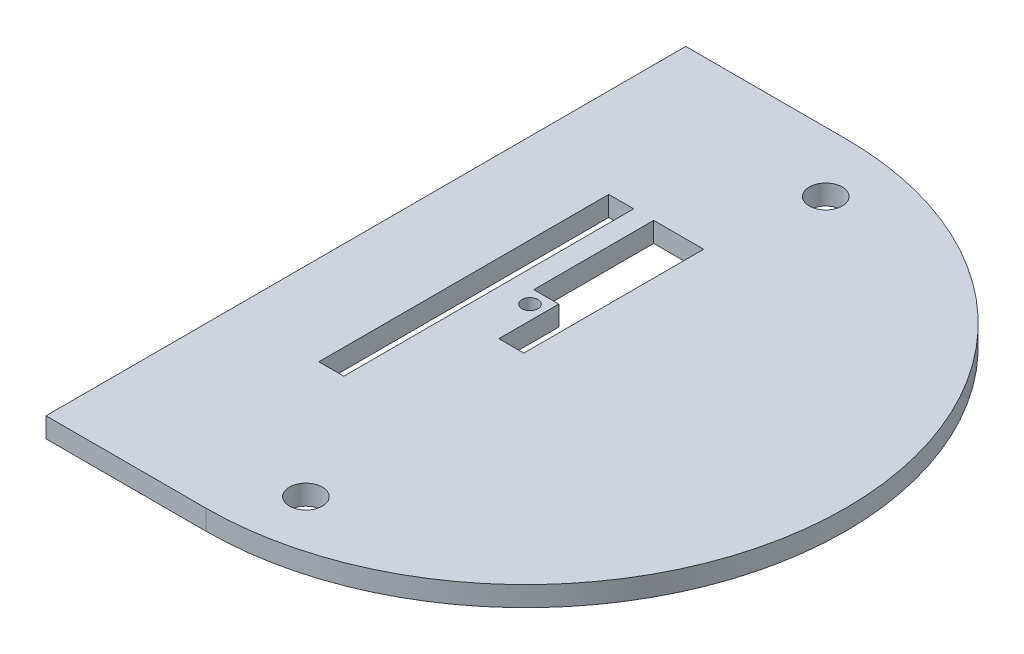
ISO-10303-21;
HEADER;
FILE_DESCRIPTION(('STEP AP214'),'2;1');
FILE_NAME('part.step','',(''),(''),'','','');
FILE_SCHEMA(('AUTOMOTIVE_DESIGN { 1 0 10303 214 1 1 1 1 }'));
ENDSEC;
DATA;
#1=APPLICATION_CONTEXT('core data for automotive mechanical design processes');
#2=APPLICATION_PROTOCOL_DEFINITION('international standard','automotive_design',2000,#1);
#3=PRODUCT_CONTEXT('',#1,'mechanical');
#4=PRODUCT('Part','Part','',(#3));
#5=PRODUCT_RELATED_PRODUCT_CATEGORY('part','',(#4));
#6=PRODUCT_DEFINITION_FORMATION('','',#4);
#7=PRODUCT_DEFINITION_CONTEXT('part definition',#1,'design');
#8=PRODUCT_DEFINITION('design','',#6,#7);
#9=PRODUCT_DEFINITION_SHAPE('','',#8);
#10=(LENGTH_UNIT() NAMED_UNIT(*) SI_UNIT(.MILLI.,.METRE.));
#11=(NAMED_UNIT(*) PLANE_ANGLE_UNIT() SI_UNIT($,.RADIAN.));
#12=(NAMED_UNIT(*) SI_UNIT($,.STERADIAN.) SOLID_ANGLE_UNIT());
#13=UNCERTAINTY_MEASURE_WITH_UNIT(LENGTH_MEASURE(1.E-05),#10,'distance_accuracy_value','');
#14=(GEOMETRIC_REPRESENTATION_CONTEXT(3) GLOBAL_UNCERTAINTY_ASSIGNED_CONTEXT((#13)) GLOBAL_UNIT_ASSIGNED_CONTEXT((#10,
#11,#12)) REPRESENTATION_CONTEXT('',''));
#15=CARTESIAN_POINT('',(0.,0.,0.));
#16=DIRECTION('',(0.,0.,1.));
#17=DIRECTION('',(1.,0.,0.));
#18=AXIS2_PLACEMENT_3D('',#15,#16,#17);
#19=CARTESIAN_POINT('',(0.,2.,52.2794018723784));
#20=DIRECTION('',(0.,0.,-1.));
#21=DIRECTION('',(-1.,0.,0.));
#22=AXIS2_PLACEMENT_3D('',#19,#20,#21);
#23=PLANE('',#22);
#24=DIRECTION('',(1.,0.,0.));
#25=VECTOR('',#24,1.);
#26=CARTESIAN_POINT('',(0.,0.,52.2794018723784));
#27=LINE('',#26,#25);
#28=CARTESIAN_POINT('',(-71.2900934623342,0.,52.2794018723784));
#29=VERTEX_POINT('',#28);
#30=CARTESIAN_POINT('',(-55.2900934623342,0.,52.2794018723784));
#31=VERTEX_POINT('',#30);
#32=EDGE_CURVE('E203',#29,#31,#27,.T.);
#33=ORIENTED_EDGE('',*,*,#32,.T.);
#34=DIRECTION('',(0.,-1.,0.));
#35=VECTOR('',#34,1.);
#36=CARTESIAN_POINT('',(-55.2900934623342,2.,52.2794018723784));
#37=LINE('',#36,#35);
#38=CARTESIAN_POINT('',(-55.2900934623342,2.,52.2794018723784));
#39=VERTEX_POINT('',#38);
#40=EDGE_CURVE('E11',#39,#31,#37,.T.);
#41=ORIENTED_EDGE('',*,*,#40,.F.);
#42=DIRECTION('',(1.,0.,0.));
#43=VECTOR('',#42,1.);
#44=CARTESIAN_POINT('',(0.,2.,52.2794018723784));
#45=LINE('',#44,#43);
#46=CARTESIAN_POINT('',(-71.2900934623342,2.,52.2794018723784));
#47=VERTEX_POINT('',#46);
#48=EDGE_CURVE('E155',#47,#39,#45,.T.);
#49=ORIENTED_EDGE('',*,*,#48,.F.);
#50=DIRECTION('',(0.,-1.,0.));
#51=VECTOR('',#50,1.);
#52=CARTESIAN_POINT('',(-71.2900934623342,2.,52.2794018723784));
#53=LINE('',#52,#51);
#54=EDGE_CURVE('E210',#47,#29,#53,.T.);
#55=ORIENTED_EDGE('',*,*,#54,.T.);
#56=EDGE_LOOP('',(#33,#41,#49,#55));
#57=FACE_BOUND('',#56,.T.);
#58=ADVANCED_FACE('F37',(#57),#23,.F.);
#59=CARTESIAN_POINT('',(-55.2900934623342,2.,20.2794018723784));
#60=DIRECTION('',(0.,-1.,0.));
#61=DIRECTION('',(0.,0.,-1.));
#62=AXIS2_PLACEMENT_3D('',#59,#60,#61);
#63=CYLINDRICAL_SURFACE('',#62,32.);
#64=CARTESIAN_POINT('',(-55.2900934623342,0.,20.2794018723784));
#65=DIRECTION('',(0.,1.,0.));
#66=DIRECTION('',(0.,0.,1.));
#67=AXIS2_PLACEMENT_3D('',#64,#65,#66);
#68=CIRCLE('',#67,32.);
#69=CARTESIAN_POINT('',(-55.2900934623342,0.,-11.7205981276216));
#70=VERTEX_POINT('',#69);
#71=EDGE_CURVE('E160',#31,#70,#68,.T.);
#72=ORIENTED_EDGE('',*,*,#71,.T.);
#73=DIRECTION('',(0.,-1.,0.));
#74=VECTOR('',#73,1.);
#75=CARTESIAN_POINT('',(-55.2900934623342,2.,-11.7205981276216));
#76=LINE('',#75,#74);
#77=CARTESIAN_POINT('',(-55.2900934623342,2.,-11.7205981276216));
#78=VERTEX_POINT('',#77);
#79=EDGE_CURVE('E47',#78,#70,#76,.T.);
#80=ORIENTED_EDGE('',*,*,#79,.F.);
#81=CARTESIAN_POINT('',(-55.2900934623342,2.,20.2794018723784));
#82=DIRECTION('',(0.,1.,0.));
#83=DIRECTION('',(0.,0.,1.));
#84=AXIS2_PLACEMENT_3D('',#81,#82,#83);
#85=CIRCLE('',#84,32.);
#86=EDGE_CURVE('E149',#39,#78,#85,.T.);
#87=ORIENTED_EDGE('',*,*,#86,.F.);
#88=ORIENTED_EDGE('',*,*,#40,.T.);
#89=EDGE_LOOP('',(#72,#80,#87,#88));
#90=FACE_BOUND('',#89,.T.);
#91=ADVANCED_FACE('F159',(#90),#63,.T.);
#92=CARTESIAN_POINT('',(0.,2.,-11.7205981276216));
#93=DIRECTION('',(0.,0.,1.));
#94=DIRECTION('',(1.,0.,0.));
#95=AXIS2_PLACEMENT_3D('',#92,#93,#94);
#96=PLANE('',#95);
#97=DIRECTION('',(-1.,0.,0.));
#98=VECTOR('',#97,1.);
#99=CARTESIAN_POINT('',(0.,0.,-11.7205981276216));
#100=LINE('',#99,#98);
#101=CARTESIAN_POINT('',(-71.2900934623342,0.,-11.7205981276216));
#102=VERTEX_POINT('',#101);
#103=EDGE_CURVE('E103',#70,#102,#100,.T.);
#104=ORIENTED_EDGE('',*,*,#103,.T.);
#105=DIRECTION('',(0.,-1.,0.));
#106=VECTOR('',#105,1.);
#107=CARTESIAN_POINT('',(-71.2900934623342,2.,-11.7205981276216));
#108=LINE('',#107,#106);
#109=CARTESIAN_POINT('',(-71.2900934623342,2.,-11.7205981276216));
#110=VERTEX_POINT('',#109);
#111=EDGE_CURVE('E161',#110,#102,#108,.T.);
#112=ORIENTED_EDGE('',*,*,#111,.F.);
#113=DIRECTION('',(-1.,0.,0.));
#114=VECTOR('',#113,1.);
#115=CARTESIAN_POINT('',(0.,2.,-11.7205981276216));
#116=LINE('',#115,#114);
#117=EDGE_CURVE('E153',#78,#110,#116,.T.);
#118=ORIENTED_EDGE('',*,*,#117,.F.);
#119=ORIENTED_EDGE('',*,*,#79,.T.);
#120=EDGE_LOOP('',(#104,#112,#118,#119));
#121=FACE_BOUND('',#120,.T.);
#122=ADVANCED_FACE('F163',(#121),#96,.F.);
#123=CARTESIAN_POINT('',(0.,2.,4.95310922918399));
#124=DIRECTION('',(0.,0.,-1.));
#125=DIRECTION('',(-1.,0.,0.));
#126=AXIS2_PLACEMENT_3D('',#123,#124,#125);
#127=PLANE('',#126);
#128=DIRECTION('',(1.,0.,0.));
#129=VECTOR('',#128,1.);
#130=CARTESIAN_POINT('',(0.,0.,4.95310922918399));
#131=LINE('',#130,#129);
#132=CARTESIAN_POINT('',(-62.32331882412,0.,4.95310922918399));
#133=VERTEX_POINT('',#132);
#134=CARTESIAN_POINT('',(-59.82331882412,0.,4.95310922918399));
#135=VERTEX_POINT('',#134);
#136=EDGE_CURVE('E191',#133,#135,#131,.T.);
#137=ORIENTED_EDGE('',*,*,#136,.T.);
#138=DIRECTION('',(0.,-1.,0.));
#139=VECTOR('',#138,1.);
#140=CARTESIAN_POINT('',(-59.82331882412,2.,4.95310922918399));
#141=LINE('',#140,#139);
#142=CARTESIAN_POINT('',(-59.82331882412,2.,4.95310922918399));
#143=VERTEX_POINT('',#142);
#144=EDGE_CURVE('E212',#143,#135,#141,.T.);
#145=ORIENTED_EDGE('',*,*,#144,.F.);
#146=DIRECTION('',(1.,0.,0.));
#147=VECTOR('',#146,1.);
#148=CARTESIAN_POINT('',(0.,2.,4.95310922918399));
#149=LINE('',#148,#147);
#150=CARTESIAN_POINT('',(-62.32331882412,2.,4.95310922918399));
#151=VERTEX_POINT('',#150);
#152=EDGE_CURVE('E260',#151,#143,#149,.T.);
#153=ORIENTED_EDGE('',*,*,#152,.F.);
#154=DIRECTION('',(0.,-1.,0.));
#155=VECTOR('',#154,1.);
#156=CARTESIAN_POINT('',(-62.32331882412,2.,4.95310922918399));
#157=LINE('',#156,#155);
#158=EDGE_CURVE('E214',#151,#133,#157,.T.);
#159=ORIENTED_EDGE('',*,*,#158,.T.);
#160=EDGE_LOOP('',(#137,#145,#153,#159));
#161=FACE_BOUND('',#160,.T.);
#162=ADVANCED_FACE('F288',(#161),#127,.F.);
#163=CARTESIAN_POINT('',(-59.82331882412,2.,0.));
#164=DIRECTION('',(-1.,0.,0.));
#165=DIRECTION('',(0.,0.,1.));
#166=AXIS2_PLACEMENT_3D('',#163,#164,#165);
#167=PLANE('',#166);
#168=DIRECTION('',(0.,0.,-1.));
#169=VECTOR('',#168,1.);
#170=CARTESIAN_POINT('',(-59.82331882412,0.,0.));
#171=LINE('',#170,#169);
#172=CARTESIAN_POINT('',(-59.82331882412,0.,33.953109229184));
#173=VERTEX_POINT('',#172);
#174=EDGE_CURVE('E194',#173,#135,#171,.T.);
#175=ORIENTED_EDGE('',*,*,#174,.F.);
#176=DIRECTION('',(0.,-1.,0.));
#177=VECTOR('',#176,1.);
#178=CARTESIAN_POINT('',(-59.82331882412,2.,33.953109229184));
#179=LINE('',#178,#177);
#180=CARTESIAN_POINT('',(-59.82331882412,2.,33.953109229184));
#181=VERTEX_POINT('',#180);
#182=EDGE_CURVE('E218',#181,#173,#179,.T.);
#183=ORIENTED_EDGE('',*,*,#182,.F.);
#184=DIRECTION('',(0.,0.,-1.));
#185=VECTOR('',#184,1.);
#186=CARTESIAN_POINT('',(-59.82331882412,2.,0.));
#187=LINE('',#186,#185);
#188=EDGE_CURVE('E262',#181,#143,#187,.T.);
#189=ORIENTED_EDGE('',*,*,#188,.T.);
#190=ORIENTED_EDGE('',*,*,#144,.T.);
#191=EDGE_LOOP('',(#175,#183,#189,#190));
#192=FACE_BOUND('',#191,.T.);
#193=ADVANCED_FACE('F290',(#192),#167,.T.);
#194=CARTESIAN_POINT('',(0.,2.,33.953109229184));
#195=DIRECTION('',(0.,0.,-1.));
#196=DIRECTION('',(-1.,0.,0.));
#197=AXIS2_PLACEMENT_3D('',#194,#195,#196);
#198=PLANE('',#197);
#199=DIRECTION('',(1.,0.,0.));
#200=VECTOR('',#199,1.);
#201=CARTESIAN_POINT('',(0.,0.,33.953109229184));
#202=LINE('',#201,#200);
#203=CARTESIAN_POINT('',(-62.32331882412,0.,33.953109229184));
#204=VERTEX_POINT('',#203);
#205=EDGE_CURVE('E197',#204,#173,#202,.T.);
#206=ORIENTED_EDGE('',*,*,#205,.F.);
#207=DIRECTION('',(0.,-1.,0.));
#208=VECTOR('',#207,1.);
#209=CARTESIAN_POINT('',(-62.32331882412,2.,33.953109229184));
#210=LINE('',#209,#208);
#211=CARTESIAN_POINT('',(-62.32331882412,2.,33.953109229184));
#212=VERTEX_POINT('',#211);
#213=EDGE_CURVE('E216',#212,#204,#210,.T.);
#214=ORIENTED_EDGE('',*,*,#213,.F.);
#215=DIRECTION('',(1.,0.,0.));
#216=VECTOR('',#215,1.);
#217=CARTESIAN_POINT('',(0.,2.,33.953109229184));
#218=LINE('',#217,#216);
#219=EDGE_CURVE('E265',#212,#181,#218,.T.);
#220=ORIENTED_EDGE('',*,*,#219,.T.);
#221=ORIENTED_EDGE('',*,*,#182,.T.);
#222=EDGE_LOOP('',(#206,#214,#220,#221));
#223=FACE_BOUND('',#222,.T.);
#224=ADVANCED_FACE('F281',(#223),#198,.T.);
#225=CARTESIAN_POINT('',(-57.82331882412,2.,0.));
#226=DIRECTION('',(1.,0.,0.));
#227=DIRECTION('',(0.,0.,-1.));
#228=AXIS2_PLACEMENT_3D('',#225,#226,#227);
#229=PLANE('',#228);
#230=DIRECTION('',(0.,0.,1.));
#231=VECTOR('',#230,1.);
#232=CARTESIAN_POINT('',(-57.82331882412,0.,0.));
#233=LINE('',#232,#231);
#234=CARTESIAN_POINT('',(-57.82331882412,0.,4.95310922918399));
#235=VERTEX_POINT('',#234);
#236=CARTESIAN_POINT('',(-57.82331882412,0.,16.953109229184));
#237=VERTEX_POINT('',#236);
#238=EDGE_CURVE('E169',#235,#237,#233,.T.);
#239=ORIENTED_EDGE('',*,*,#238,.F.);
#240=DIRECTION('',(0.,-1.,0.));
#241=VECTOR('',#240,1.);
#242=CARTESIAN_POINT('',(-57.82331882412,2.,4.95310922918399));
#243=LINE('',#242,#241);
#244=CARTESIAN_POINT('',(-57.82331882412,2.,4.95310922918399));
#245=VERTEX_POINT('',#244);
#246=EDGE_CURVE('E117',#245,#235,#243,.T.);
#247=ORIENTED_EDGE('',*,*,#246,.F.);
#248=DIRECTION('',(0.,0.,1.));
#249=VECTOR('',#248,1.);
#250=CARTESIAN_POINT('',(-57.82331882412,2.,0.));
#251=LINE('',#250,#249);
#252=CARTESIAN_POINT('',(-57.82331882412,2.,16.953109229184));
#253=VERTEX_POINT('',#252);
#254=EDGE_CURVE('E209',#245,#253,#251,.T.);
#255=ORIENTED_EDGE('',*,*,#254,.T.);
#256=DIRECTION('',(0.,-1.,0.));
#257=VECTOR('',#256,1.);
#258=CARTESIAN_POINT('',(-57.82331882412,2.,16.953109229184));
#259=LINE('',#258,#257);
#260=EDGE_CURVE('E165',#253,#237,#259,.T.);
#261=ORIENTED_EDGE('',*,*,#260,.T.);
#262=EDGE_LOOP('',(#239,#247,#255,#261));
#263=FACE_BOUND('',#262,.T.);
#264=ADVANCED_FACE('F39',(#263),#229,.T.);
#265=CARTESIAN_POINT('',(0.,2.,4.95310922918399));
#266=DIRECTION('',(0.,0.,-1.));
#267=DIRECTION('',(-1.,0.,0.));
#268=AXIS2_PLACEMENT_3D('',#265,#266,#267);
#269=PLANE('',#268);
#270=DIRECTION('',(1.,0.,0.));
#271=VECTOR('',#270,1.);
#272=CARTESIAN_POINT('',(0.,0.,4.95310922918399));
#273=LINE('',#272,#271);
#274=CARTESIAN_POINT('',(-52.82331882412,0.,4.95310922918399));
#275=VERTEX_POINT('',#274);
#276=EDGE_CURVE('E172',#235,#275,#273,.T.);
#277=ORIENTED_EDGE('',*,*,#276,.T.);
#278=DIRECTION('',(0.,-1.,0.));
#279=VECTOR('',#278,1.);
#280=CARTESIAN_POINT('',(-52.82331882412,2.,4.95310922918399));
#281=LINE('',#280,#279);
#282=CARTESIAN_POINT('',(-52.82331882412,2.,4.95310922918399));
#283=VERTEX_POINT('',#282);
#284=EDGE_CURVE('E228',#283,#275,#281,.T.);
#285=ORIENTED_EDGE('',*,*,#284,.F.);
#286=DIRECTION('',(1.,0.,0.));
#287=VECTOR('',#286,1.);
#288=CARTESIAN_POINT('',(0.,2.,4.95310922918399));
#289=LINE('',#288,#287);
#290=EDGE_CURVE('E243',#245,#283,#289,.T.);
#291=ORIENTED_EDGE('',*,*,#290,.F.);
#292=ORIENTED_EDGE('',*,*,#246,.T.);
#293=EDGE_LOOP('',(#277,#285,#291,#292));
#294=FACE_BOUND('',#293,.T.);
#295=ADVANCED_FACE('F331',(#294),#269,.F.);
#296=CARTESIAN_POINT('',(-52.82331882412,2.,0.));
#297=DIRECTION('',(-1.,0.,0.));
#298=DIRECTION('',(0.,0.,1.));
#299=AXIS2_PLACEMENT_3D('',#296,#297,#298);
#300=PLANE('',#299);
#301=DIRECTION('',(0.,0.,-1.));
#302=VECTOR('',#301,1.);
#303=CARTESIAN_POINT('',(-52.82331882412,0.,0.));
#304=LINE('',#303,#302);
#305=CARTESIAN_POINT('',(-52.82331882412,0.,22.953109229184));
#306=VERTEX_POINT('',#305);
#307=EDGE_CURVE('E176',#306,#275,#304,.T.);
#308=ORIENTED_EDGE('',*,*,#307,.F.);
#309=DIRECTION('',(0.,-1.,0.));
#310=VECTOR('',#309,1.);
#311=CARTESIAN_POINT('',(-52.82331882412,2.,22.953109229184));
#312=LINE('',#311,#310);
#313=CARTESIAN_POINT('',(-52.82331882412,2.,22.953109229184));
#314=VERTEX_POINT('',#313);
#315=EDGE_CURVE('E226',#314,#306,#312,.T.);
#316=ORIENTED_EDGE('',*,*,#315,.F.);
#317=DIRECTION('',(0.,0.,-1.));
#318=VECTOR('',#317,1.);
#319=CARTESIAN_POINT('',(-52.82331882412,2.,0.));
#320=LINE('',#319,#318);
#321=EDGE_CURVE('E245',#314,#283,#320,.T.);
#322=ORIENTED_EDGE('',*,*,#321,.T.);
#323=ORIENTED_EDGE('',*,*,#284,.T.);
#324=EDGE_LOOP('',(#308,#316,#322,#323));
#325=FACE_BOUND('',#324,.T.);
#326=ADVANCED_FACE('F324',(#325),#300,.T.);
#327=CARTESIAN_POINT('',(0.,2.,22.953109229184));
#328=DIRECTION('',(0.,0.,-1.));
#329=DIRECTION('',(-1.,0.,0.));
#330=AXIS2_PLACEMENT_3D('',#327,#328,#329);
#331=PLANE('',#330);
#332=DIRECTION('',(1.,0.,0.));
#333=VECTOR('',#332,1.);
#334=CARTESIAN_POINT('',(0.,0.,22.953109229184));
#335=LINE('',#334,#333);
#336=CARTESIAN_POINT('',(-55.32331882412,0.,22.953109229184));
#337=VERTEX_POINT('',#336);
#338=EDGE_CURVE('E179',#337,#306,#335,.T.);
#339=ORIENTED_EDGE('',*,*,#338,.F.);
#340=DIRECTION('',(0.,-1.,0.));
#341=VECTOR('',#340,1.);
#342=CARTESIAN_POINT('',(-55.32331882412,2.,22.953109229184));
#343=LINE('',#342,#341);
#344=CARTESIAN_POINT('',(-55.32331882412,2.,22.953109229184));
#345=VERTEX_POINT('',#344);
#346=EDGE_CURVE('E224',#345,#337,#343,.T.);
#347=ORIENTED_EDGE('',*,*,#346,.F.);
#348=DIRECTION('',(1.,0.,0.));
#349=VECTOR('',#348,1.);
#350=CARTESIAN_POINT('',(0.,2.,22.953109229184));
#351=LINE('',#350,#349);
#352=EDGE_CURVE('E248',#345,#314,#351,.T.);
#353=ORIENTED_EDGE('',*,*,#352,.T.);
#354=ORIENTED_EDGE('',*,*,#315,.T.);
#355=EDGE_LOOP('',(#339,#347,#353,#354));
#356=FACE_BOUND('',#355,.T.);
#357=ADVANCED_FACE('F318',(#356),#331,.T.);
#358=CARTESIAN_POINT('',(-55.32331882412,2.,0.));
#359=DIRECTION('',(1.,0.,0.));
#360=DIRECTION('',(0.,0.,-1.));
#361=AXIS2_PLACEMENT_3D('',#358,#359,#360);
#362=PLANE('',#361);
#363=DIRECTION('',(0.,0.,1.));
#364=VECTOR('',#363,1.);
#365=CARTESIAN_POINT('',(-55.32331882412,0.,0.));
#366=LINE('',#365,#364);
#367=CARTESIAN_POINT('',(-55.32331882412,0.,16.953109229184));
#368=VERTEX_POINT('',#367);
#369=EDGE_CURVE('E182',#368,#337,#366,.T.);
#370=ORIENTED_EDGE('',*,*,#369,.F.);
#371=DIRECTION('',(0.,-1.,0.));
#372=VECTOR('',#371,1.);
#373=CARTESIAN_POINT('',(-55.32331882412,2.,16.953109229184));
#374=LINE('',#373,#372);
#375=CARTESIAN_POINT('',(-55.32331882412,2.,16.953109229184));
#376=VERTEX_POINT('',#375);
#377=EDGE_CURVE('E222',#376,#368,#374,.T.);
#378=ORIENTED_EDGE('',*,*,#377,.F.);
#379=DIRECTION('',(0.,0.,1.));
#380=VECTOR('',#379,1.);
#381=CARTESIAN_POINT('',(-55.32331882412,2.,0.));
#382=LINE('',#381,#380);
#383=EDGE_CURVE('E251',#376,#345,#382,.T.);
#384=ORIENTED_EDGE('',*,*,#383,.T.);
#385=ORIENTED_EDGE('',*,*,#346,.T.);
#386=EDGE_LOOP('',(#370,#378,#384,#385));
#387=FACE_BOUND('',#386,.T.);
#388=ADVANCED_FACE('F310',(#387),#362,.T.);
#389=CARTESIAN_POINT('',(-62.32331882412,2.,0.));
#390=DIRECTION('',(1.,0.,0.));
#391=DIRECTION('',(0.,0.,-1.));
#392=AXIS2_PLACEMENT_3D('',#389,#390,#391);
#393=PLANE('',#392);
#394=DIRECTION('',(0.,0.,1.));
#395=VECTOR('',#394,1.);
#396=CARTESIAN_POINT('',(-62.32331882412,0.,0.));
#397=LINE('',#396,#395);
#398=EDGE_CURVE('E200',#133,#204,#397,.T.);
#399=ORIENTED_EDGE('',*,*,#398,.F.);
#400=ORIENTED_EDGE('',*,*,#158,.F.);
#401=DIRECTION('',(0.,0.,1.));
#402=VECTOR('',#401,1.);
#403=CARTESIAN_POINT('',(-62.32331882412,2.,0.));
#404=LINE('',#403,#402);
#405=EDGE_CURVE('E268',#151,#212,#404,.T.);
#406=ORIENTED_EDGE('',*,*,#405,.T.);
#407=ORIENTED_EDGE('',*,*,#213,.T.);
#408=EDGE_LOOP('',(#399,#400,#406,#407));
#409=FACE_BOUND('',#408,.T.);
#410=ADVANCED_FACE('F273',(#409),#393,.T.);
#411=CARTESIAN_POINT('',(-56.7542262462799,2.,18.397495978921));
#412=DIRECTION('',(0.,-1.,0.));
#413=DIRECTION('',(0.,0.,-1.));
#414=AXIS2_PLACEMENT_3D('',#411,#412,#413);
#415=CYLINDRICAL_SURFACE('',#414,0.799999999999995);
#416=CARTESIAN_POINT('',(-56.7542262462799,2.,18.397495978921));
#417=DIRECTION('',(0.,1.,0.));
#418=DIRECTION('',(0.,0.,1.));
#419=AXIS2_PLACEMENT_3D('',#416,#417,#418);
#420=CIRCLE('',#419,0.799999999999995);
#421=CARTESIAN_POINT('',(-56.7542262462799,2.,19.197495978921));
#422=VERTEX_POINT('',#421);
#423=EDGE_CURVE('E257',#422,#422,#420,.T.);
#424=ORIENTED_EDGE('',*,*,#423,.T.);
#425=EDGE_LOOP('',(#424));
#426=FACE_BOUND('',#425,.T.);
#427=CARTESIAN_POINT('',(-56.7542262462799,0.,18.397495978921));
#428=DIRECTION('',(0.,1.,0.));
#429=DIRECTION('',(0.,0.,1.));
#430=AXIS2_PLACEMENT_3D('',#427,#428,#429);
#431=CIRCLE('',#430,0.799999999999995);
#432=CARTESIAN_POINT('',(-56.7542262462799,0.,19.197495978921));
#433=VERTEX_POINT('',#432);
#434=EDGE_CURVE('E188',#433,#433,#431,.T.);
#435=ORIENTED_EDGE('',*,*,#434,.F.);
#436=EDGE_LOOP('',(#435));
#437=FACE_BOUND('',#436,.T.);
#438=ADVANCED_FACE('F309',(#426,#437),#415,.F.);
#439=CARTESIAN_POINT('',(0.,2.,16.953109229184));
#440=DIRECTION('',(0.,0.,-1.));
#441=DIRECTION('',(-1.,0.,0.));
#442=AXIS2_PLACEMENT_3D('',#439,#440,#441);
#443=PLANE('',#442);
#444=DIRECTION('',(1.,0.,0.));
#445=VECTOR('',#444,1.);
#446=CARTESIAN_POINT('',(0.,0.,16.953109229184));
#447=LINE('',#446,#445);
#448=EDGE_CURVE('E185',#237,#368,#447,.T.);
#449=ORIENTED_EDGE('',*,*,#448,.F.);
#450=ORIENTED_EDGE('',*,*,#260,.F.);
#451=DIRECTION('',(1.,0.,0.));
#452=VECTOR('',#451,1.);
#453=CARTESIAN_POINT('',(0.,2.,16.953109229184));
#454=LINE('',#453,#452);
#455=EDGE_CURVE('E254',#253,#376,#454,.T.);
#456=ORIENTED_EDGE('',*,*,#455,.T.);
#457=ORIENTED_EDGE('',*,*,#377,.T.);
#458=EDGE_LOOP('',(#449,#450,#456,#457));
#459=FACE_BOUND('',#458,.T.);
#460=ADVANCED_FACE('F315',(#459),#443,.T.);
#461=CARTESIAN_POINT('',(-71.2900934623342,2.,0.));
#462=DIRECTION('',(1.,0.,0.));
#463=DIRECTION('',(0.,0.,-1.));
#464=AXIS2_PLACEMENT_3D('',#461,#462,#463);
#465=PLANE('',#464);
#466=DIRECTION('',(0.,0.,1.));
#467=VECTOR('',#466,1.);
#468=CARTESIAN_POINT('',(-71.2900934623342,0.,0.));
#469=LINE('',#468,#467);
#470=EDGE_CURVE('E109',#102,#29,#469,.T.);
#471=ORIENTED_EDGE('',*,*,#470,.T.);
#472=ORIENTED_EDGE('',*,*,#54,.F.);
#473=DIRECTION('',(0.,0.,1.));
#474=VECTOR('',#473,1.);
#475=CARTESIAN_POINT('',(-71.2900934623342,2.,0.));
#476=LINE('',#475,#474);
#477=EDGE_CURVE('E56',#110,#47,#476,.T.);
#478=ORIENTED_EDGE('',*,*,#477,.F.);
#479=ORIENTED_EDGE('',*,*,#111,.T.);
#480=EDGE_LOOP('',(#471,#472,#478,#479));
#481=FACE_BOUND('',#480,.T.);
#482=ADVANCED_FACE('F354',(#481),#465,.F.);
#483=CARTESIAN_POINT('',(0.,2.,0.));
#484=DIRECTION('',(0.,1.,0.));
#485=DIRECTION('',(0.,0.,1.));
#486=AXIS2_PLACEMENT_3D('',#483,#484,#485);
#487=PLANE('',#486);
#488=CARTESIAN_POINT('',(-51.2900934623342,2.,-5.72059812762162));
#489=DIRECTION('',(0.,1.,0.));
#490=DIRECTION('',(0.,0.,1.));
#491=AXIS2_PLACEMENT_3D('',#488,#489,#490);
#492=CIRCLE('',#491,1.65);
#493=CARTESIAN_POINT('',(-51.2900934623342,2.,-4.07059812762162));
#494=VERTEX_POINT('',#493);
#495=EDGE_CURVE('E239',#494,#494,#492,.T.);
#496=ORIENTED_EDGE('',*,*,#495,.F.);
#497=EDGE_LOOP('',(#496));
#498=FACE_BOUND('',#497,.T.);
#499=CARTESIAN_POINT('',(-51.2900934623342,2.,46.2794018723784));
#500=DIRECTION('',(0.,1.,0.));
#501=DIRECTION('',(0.,0.,1.));
#502=AXIS2_PLACEMENT_3D('',#499,#500,#501);
#503=CIRCLE('',#502,1.65);
#504=CARTESIAN_POINT('',(-51.2900934623342,2.,47.9294018723784));
#505=VERTEX_POINT('',#504);
#506=EDGE_CURVE('E231',#505,#505,#503,.T.);
#507=ORIENTED_EDGE('',*,*,#506,.F.);
#508=EDGE_LOOP('',(#507));
#509=FACE_BOUND('',#508,.T.);
#510=ORIENTED_EDGE('',*,*,#254,.F.);
#511=ORIENTED_EDGE('',*,*,#290,.T.);
#512=ORIENTED_EDGE('',*,*,#321,.F.);
#513=ORIENTED_EDGE('',*,*,#352,.F.);
#514=ORIENTED_EDGE('',*,*,#383,.F.);
#515=ORIENTED_EDGE('',*,*,#455,.F.);
#516=EDGE_LOOP('',(#510,#511,#512,#513,#514,#515));
#517=FACE_BOUND('',#516,.T.);
#518=ORIENTED_EDGE('',*,*,#423,.F.);
#519=EDGE_LOOP('',(#518));
#520=FACE_BOUND('',#519,.T.);
#521=ORIENTED_EDGE('',*,*,#152,.T.);
#522=ORIENTED_EDGE('',*,*,#188,.F.);
#523=ORIENTED_EDGE('',*,*,#219,.F.);
#524=ORIENTED_EDGE('',*,*,#405,.F.);
#525=EDGE_LOOP('',(#521,#522,#523,#524));
#526=FACE_BOUND('',#525,.T.);
#527=ORIENTED_EDGE('',*,*,#48,.T.);
#528=ORIENTED_EDGE('',*,*,#86,.T.);
#529=ORIENTED_EDGE('',*,*,#117,.T.);
#530=ORIENTED_EDGE('',*,*,#477,.T.);
#531=EDGE_LOOP('',(#527,#528,#529,#530));
#532=FACE_BOUND('',#531,.T.);
#533=ADVANCED_FACE('F151',(#498,#509,#517,#520,#526,#532),#487,.T.);
#534=CARTESIAN_POINT('',(0.,0.,0.));
#535=DIRECTION('',(0.,1.,0.));
#536=DIRECTION('',(0.,0.,1.));
#537=AXIS2_PLACEMENT_3D('',#534,#535,#536);
#538=PLANE('',#537);
#539=CARTESIAN_POINT('',(-51.2900934623342,0.,-5.72059812762162));
#540=DIRECTION('',(0.,1.,0.));
#541=DIRECTION('',(0.,0.,1.));
#542=AXIS2_PLACEMENT_3D('',#539,#540,#541);
#543=CIRCLE('',#542,1.65);
#544=CARTESIAN_POINT('',(-51.2900934623342,0.,-4.07059812762162));
#545=VERTEX_POINT('',#544);
#546=EDGE_CURVE('E41',#545,#545,#543,.T.);
#547=ORIENTED_EDGE('',*,*,#546,.T.);
#548=EDGE_LOOP('',(#547));
#549=FACE_BOUND('',#548,.T.);
#550=CARTESIAN_POINT('',(-51.2900934623342,0.,46.2794018723784));
#551=DIRECTION('',(0.,1.,0.));
#552=DIRECTION('',(0.,0.,1.));
#553=AXIS2_PLACEMENT_3D('',#550,#551,#552);
#554=CIRCLE('',#553,1.65);
#555=CARTESIAN_POINT('',(-51.2900934623342,0.,47.9294018723784));
#556=VERTEX_POINT('',#555);
#557=EDGE_CURVE('E173',#556,#556,#554,.T.);
#558=ORIENTED_EDGE('',*,*,#557,.T.);
#559=EDGE_LOOP('',(#558));
#560=FACE_BOUND('',#559,.T.);
#561=ORIENTED_EDGE('',*,*,#238,.T.);
#562=ORIENTED_EDGE('',*,*,#448,.T.);
#563=ORIENTED_EDGE('',*,*,#369,.T.);
#564=ORIENTED_EDGE('',*,*,#338,.T.);
#565=ORIENTED_EDGE('',*,*,#307,.T.);
#566=ORIENTED_EDGE('',*,*,#276,.F.);
#567=EDGE_LOOP('',(#561,#562,#563,#564,#565,#566));
#568=FACE_BOUND('',#567,.T.);
#569=ORIENTED_EDGE('',*,*,#434,.T.);
#570=EDGE_LOOP('',(#569));
#571=FACE_BOUND('',#570,.T.);
#572=ORIENTED_EDGE('',*,*,#136,.F.);
#573=ORIENTED_EDGE('',*,*,#398,.T.);
#574=ORIENTED_EDGE('',*,*,#205,.T.);
#575=ORIENTED_EDGE('',*,*,#174,.T.);
#576=EDGE_LOOP('',(#572,#573,#574,#575));
#577=FACE_BOUND('',#576,.T.);
#578=ORIENTED_EDGE('',*,*,#32,.F.);
#579=ORIENTED_EDGE('',*,*,#470,.F.);
#580=ORIENTED_EDGE('',*,*,#103,.F.);
#581=ORIENTED_EDGE('',*,*,#71,.F.);
#582=EDGE_LOOP('',(#578,#579,#580,#581));
#583=FACE_BOUND('',#582,.T.);
#584=ADVANCED_FACE('F285',(#549,#560,#568,#571,#577,#583),#538,.F.);
#585=CARTESIAN_POINT('',(-51.2900934623342,2.,46.2794018723784));
#586=DIRECTION('',(0.,1.,0.));
#587=DIRECTION('',(0.,0.,1.));
#588=AXIS2_PLACEMENT_3D('',#585,#586,#587);
#589=CYLINDRICAL_SURFACE('',#588,1.65);
#590=ORIENTED_EDGE('',*,*,#506,.T.);
#591=EDGE_LOOP('',(#590));
#592=FACE_BOUND('',#591,.T.);
#593=ORIENTED_EDGE('',*,*,#557,.F.);
#594=EDGE_LOOP('',(#593));
#595=FACE_BOUND('',#594,.T.);
#596=ADVANCED_FACE('F443',(#592,#595),#589,.F.);
#597=CARTESIAN_POINT('',(-51.2900934623342,2.,-5.72059812762162));
#598=DIRECTION('',(0.,1.,0.));
#599=DIRECTION('',(0.,0.,1.));
#600=AXIS2_PLACEMENT_3D('',#597,#598,#599);
#601=CYLINDRICAL_SURFACE('',#600,1.65);
#602=ORIENTED_EDGE('',*,*,#495,.T.);
#603=EDGE_LOOP('',(#602));
#604=FACE_BOUND('',#603,.T.);
#605=ORIENTED_EDGE('',*,*,#546,.F.);
#606=EDGE_LOOP('',(#605));
#607=FACE_BOUND('',#606,.T.);
#608=ADVANCED_FACE('F453',(#604,#607),#601,.F.);
#609=CLOSED_SHELL('',(#58,#91,#122,#162,#193,#224,#264,#295,#326,#357,#388,#410,#438,#460,#482,
#533,#584,#596,#608));
#610=MANIFOLD_SOLID_BREP('B2',#609);
#611=ADVANCED_BREP_SHAPE_REPRESENTATION('',(#18,#610),#14);
#612=SHAPE_DEFINITION_REPRESENTATION(#9,#611);
ENDSEC;
END-ISO-10303-21;
